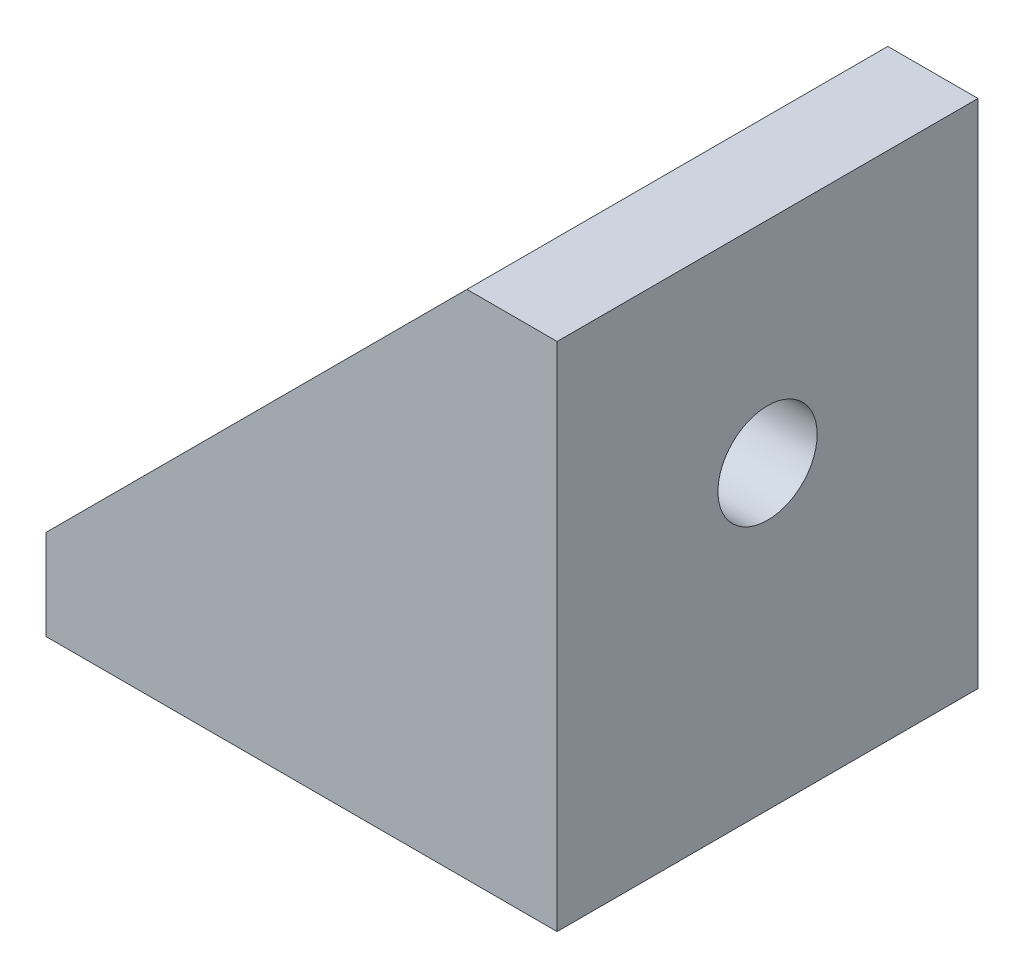
ISO-10303-21;
HEADER;
FILE_DESCRIPTION(('STEP AP214'),'2;1');
FILE_NAME('part.step','',(''),(''),'','','');
FILE_SCHEMA(('AUTOMOTIVE_DESIGN { 1 0 10303 214 1 1 1 1 }'));
ENDSEC;
DATA;
#1=APPLICATION_CONTEXT('core data for automotive mechanical design processes');
#2=APPLICATION_PROTOCOL_DEFINITION('international standard','automotive_design',2000,#1);
#3=PRODUCT_CONTEXT('',#1,'mechanical');
#4=PRODUCT('Part','Part','',(#3));
#5=PRODUCT_RELATED_PRODUCT_CATEGORY('part','',(#4));
#6=PRODUCT_DEFINITION_FORMATION('','',#4);
#7=PRODUCT_DEFINITION_CONTEXT('part definition',#1,'design');
#8=PRODUCT_DEFINITION('design','',#6,#7);
#9=PRODUCT_DEFINITION_SHAPE('','',#8);
#10=(LENGTH_UNIT() NAMED_UNIT(*) SI_UNIT(.MILLI.,.METRE.));
#11=(NAMED_UNIT(*) PLANE_ANGLE_UNIT() SI_UNIT($,.RADIAN.));
#12=(NAMED_UNIT(*) SI_UNIT($,.STERADIAN.) SOLID_ANGLE_UNIT());
#13=UNCERTAINTY_MEASURE_WITH_UNIT(LENGTH_MEASURE(1.E-05),#10,'distance_accuracy_value','');
#14=(GEOMETRIC_REPRESENTATION_CONTEXT(3) GLOBAL_UNCERTAINTY_ASSIGNED_CONTEXT((#13)) GLOBAL_UNIT_ASSIGNED_CONTEXT((#10,
#11,#12)) REPRESENTATION_CONTEXT('',''));
#15=CARTESIAN_POINT('',(0.,0.,0.));
#16=DIRECTION('',(0.,0.,1.));
#17=DIRECTION('',(1.,0.,0.));
#18=AXIS2_PLACEMENT_3D('',#15,#16,#17);
#19=CARTESIAN_POINT('',(0.,3.,0.));
#20=DIRECTION('',(0.,-1.,0.));
#21=DIRECTION('',(0.,0.,-1.));
#22=AXIS2_PLACEMENT_3D('',#19,#20,#21);
#23=PLANE('',#22);
#24=CARTESIAN_POINT('',(-7.,3.,-7.));
#25=DIRECTION('',(0.,1.,0.));
#26=DIRECTION('',(0.,0.,1.));
#27=AXIS2_PLACEMENT_3D('',#24,#25,#26);
#28=CIRCLE('',#27,1.75);
#29=CARTESIAN_POINT('',(-7.,3.,-5.25));
#30=VERTEX_POINT('',#29);
#31=EDGE_CURVE('E130',#30,#30,#28,.T.);
#32=ORIENTED_EDGE('',*,*,#31,.F.);
#33=EDGE_LOOP('',(#32));
#34=FACE_BOUND('',#33,.T.);
#35=DIRECTION('',(-1.,0.,0.));
#36=VECTOR('',#35,1.);
#37=CARTESIAN_POINT('',(0.,3.,-12.));
#38=LINE('',#37,#36);
#39=CARTESIAN_POINT('',(0.,3.,-12.));
#40=VERTEX_POINT('',#39);
#41=CARTESIAN_POINT('',(-14.,3.,-12.));
#42=VERTEX_POINT('',#41);
#43=EDGE_CURVE('E97',#40,#42,#38,.T.);
#44=ORIENTED_EDGE('',*,*,#43,.T.);
#45=DIRECTION('',(0.,0.,1.));
#46=VECTOR('',#45,1.);
#47=CARTESIAN_POINT('',(-14.,3.,0.));
#48=LINE('',#47,#46);
#49=CARTESIAN_POINT('',(-14.,3.,-2.));
#50=VERTEX_POINT('',#49);
#51=EDGE_CURVE('E118',#42,#50,#48,.T.);
#52=ORIENTED_EDGE('',*,*,#51,.T.);
#53=DIRECTION('',(1.,0.,0.));
#54=VECTOR('',#53,1.);
#55=CARTESIAN_POINT('',(-14.,3.,-2.));
#56=LINE('',#55,#54);
#57=CARTESIAN_POINT('',(0.,3.,-2.));
#58=VERTEX_POINT('',#57);
#59=EDGE_CURVE('E117',#50,#58,#56,.T.);
#60=ORIENTED_EDGE('',*,*,#59,.T.);
#61=DIRECTION('',(0.,0.,-1.));
#62=VECTOR('',#61,1.);
#63=CARTESIAN_POINT('',(0.,3.,-14.));
#64=LINE('',#63,#62);
#65=EDGE_CURVE('E110',#58,#40,#64,.T.);
#66=ORIENTED_EDGE('',*,*,#65,.T.);
#67=EDGE_LOOP('',(#44,#52,#60,#66));
#68=FACE_BOUND('',#67,.T.);
#69=ADVANCED_FACE('F32',(#34,#68),#23,.F.);
#70=CARTESIAN_POINT('',(0.,0.,0.));
#71=DIRECTION('',(-1.,0.,0.));
#72=DIRECTION('',(0.,0.,1.));
#73=AXIS2_PLACEMENT_3D('',#70,#71,#72);
#74=PLANE('',#73);
#75=CARTESIAN_POINT('',(0.,10.,-7.));
#76=DIRECTION('',(1.,0.,0.));
#77=DIRECTION('',(0.,0.,-1.));
#78=AXIS2_PLACEMENT_3D('',#75,#76,#77);
#79=CIRCLE('',#78,1.65);
#80=CARTESIAN_POINT('',(0.,10.,-8.65));
#81=VERTEX_POINT('',#80);
#82=EDGE_CURVE('E160',#81,#81,#79,.T.);
#83=ORIENTED_EDGE('',*,*,#82,.T.);
#84=EDGE_LOOP('',(#83));
#85=FACE_BOUND('',#84,.T.);
#86=DIRECTION('',(0.,0.,1.));
#87=VECTOR('',#86,1.);
#88=CARTESIAN_POINT('',(0.,17.,0.));
#89=LINE('',#88,#87);
#90=CARTESIAN_POINT('',(0.,17.,-12.));
#91=VERTEX_POINT('',#90);
#92=CARTESIAN_POINT('',(0.,17.,-2.));
#93=VERTEX_POINT('',#92);
#94=EDGE_CURVE('E111',#91,#93,#89,.T.);
#95=ORIENTED_EDGE('',*,*,#94,.F.);
#96=DIRECTION('',(0.,-1.,0.));
#97=VECTOR('',#96,1.);
#98=CARTESIAN_POINT('',(0.,17.,-12.));
#99=LINE('',#98,#97);
#100=EDGE_CURVE('E100',#91,#40,#99,.T.);
#101=ORIENTED_EDGE('',*,*,#100,.T.);
#102=ORIENTED_EDGE('',*,*,#65,.F.);
#103=DIRECTION('',(0.,1.,0.));
#104=VECTOR('',#103,1.);
#105=CARTESIAN_POINT('',(0.,3.,-2.));
#106=LINE('',#105,#104);
#107=EDGE_CURVE('E220',#58,#93,#106,.T.);
#108=ORIENTED_EDGE('',*,*,#107,.T.);
#109=EDGE_LOOP('',(#95,#101,#102,#108));
#110=FACE_BOUND('',#109,.T.);
#111=ADVANCED_FACE('F108',(#85,#110),#74,.T.);
#112=CARTESIAN_POINT('',(0.,0.,0.));
#113=DIRECTION('',(0.,-1.,0.));
#114=DIRECTION('',(0.,0.,-1.));
#115=AXIS2_PLACEMENT_3D('',#112,#113,#114);
#116=PLANE('',#115);
#117=DIRECTION('',(-1.,0.,0.));
#118=VECTOR('',#117,1.);
#119=CARTESIAN_POINT('',(-14.,0.,-14.));
#120=LINE('',#119,#118);
#121=CARTESIAN_POINT('',(3.,0.,-14.));
#122=VERTEX_POINT('',#121);
#123=CARTESIAN_POINT('',(-14.,0.,-14.));
#124=VERTEX_POINT('',#123);
#125=EDGE_CURVE('E128',#122,#124,#120,.T.);
#126=ORIENTED_EDGE('',*,*,#125,.F.);
#127=DIRECTION('',(0.,0.,-1.));
#128=VECTOR('',#127,1.);
#129=CARTESIAN_POINT('',(3.,0.,0.));
#130=LINE('',#129,#128);
#131=CARTESIAN_POINT('',(3.,0.,0.));
#132=VERTEX_POINT('',#131);
#133=EDGE_CURVE('E144',#132,#122,#130,.T.);
#134=ORIENTED_EDGE('',*,*,#133,.F.);
#135=DIRECTION('',(1.,0.,0.));
#136=VECTOR('',#135,1.);
#137=CARTESIAN_POINT('',(0.,0.,0.));
#138=LINE('',#137,#136);
#139=CARTESIAN_POINT('',(-14.,0.,0.));
#140=VERTEX_POINT('',#139);
#141=EDGE_CURVE('E119',#140,#132,#138,.T.);
#142=ORIENTED_EDGE('',*,*,#141,.F.);
#143=DIRECTION('',(0.,0.,1.));
#144=VECTOR('',#143,1.);
#145=CARTESIAN_POINT('',(-14.,0.,0.));
#146=LINE('',#145,#144);
#147=EDGE_CURVE('E54',#124,#140,#146,.T.);
#148=ORIENTED_EDGE('',*,*,#147,.F.);
#149=EDGE_LOOP('',(#126,#134,#142,#148));
#150=FACE_BOUND('',#149,.T.);
#151=CARTESIAN_POINT('',(-7.,0.,-7.));
#152=DIRECTION('',(0.,1.,0.));
#153=DIRECTION('',(0.,0.,1.));
#154=AXIS2_PLACEMENT_3D('',#151,#152,#153);
#155=CIRCLE('',#154,1.75);
#156=CARTESIAN_POINT('',(-7.,0.,-5.25));
#157=VERTEX_POINT('',#156);
#158=EDGE_CURVE('E125',#157,#157,#155,.T.);
#159=ORIENTED_EDGE('',*,*,#158,.T.);
#160=EDGE_LOOP('',(#159));
#161=FACE_BOUND('',#160,.T.);
#162=ADVANCED_FACE('F141',(#150,#161),#116,.T.);
#163=CARTESIAN_POINT('',(-14.,3.,-14.));
#164=DIRECTION('',(0.,0.,1.));
#165=DIRECTION('',(1.,0.,0.));
#166=AXIS2_PLACEMENT_3D('',#163,#164,#165);
#167=PLANE('',#166);
#168=DIRECTION('',(0.707106781186547,0.707106781186547,0.));
#169=VECTOR('',#168,1.);
#170=CARTESIAN_POINT('',(-14.,3.,-14.));
#171=LINE('',#170,#169);
#172=CARTESIAN_POINT('',(-14.,3.,-14.));
#173=VERTEX_POINT('',#172);
#174=CARTESIAN_POINT('',(0.,17.,-14.));
#175=VERTEX_POINT('',#174);
#176=EDGE_CURVE('E113',#173,#175,#171,.T.);
#177=ORIENTED_EDGE('',*,*,#176,.T.);
#178=DIRECTION('',(-1.,0.,0.));
#179=VECTOR('',#178,1.);
#180=CARTESIAN_POINT('',(3.,17.,-14.));
#181=LINE('',#180,#179);
#182=CARTESIAN_POINT('',(3.,17.,-14.));
#183=VERTEX_POINT('',#182);
#184=EDGE_CURVE('E167',#183,#175,#181,.T.);
#185=ORIENTED_EDGE('',*,*,#184,.F.);
#186=DIRECTION('',(0.,1.,0.));
#187=VECTOR('',#186,1.);
#188=CARTESIAN_POINT('',(3.,0.,-14.));
#189=LINE('',#188,#187);
#190=EDGE_CURVE('E148',#122,#183,#189,.T.);
#191=ORIENTED_EDGE('',*,*,#190,.F.);
#192=ORIENTED_EDGE('',*,*,#125,.T.);
#193=DIRECTION('',(0.,-1.,0.));
#194=VECTOR('',#193,1.);
#195=CARTESIAN_POINT('',(-14.,3.,-14.));
#196=LINE('',#195,#194);
#197=EDGE_CURVE('E11',#173,#124,#196,.T.);
#198=ORIENTED_EDGE('',*,*,#197,.F.);
#199=EDGE_LOOP('',(#177,#185,#191,#192,#198));
#200=FACE_BOUND('',#199,.T.);
#201=ADVANCED_FACE('F34',(#200),#167,.F.);
#202=CARTESIAN_POINT('',(-14.,3.,0.));
#203=DIRECTION('',(1.,0.,0.));
#204=DIRECTION('',(0.,0.,-1.));
#205=AXIS2_PLACEMENT_3D('',#202,#203,#204);
#206=PLANE('',#205);
#207=ORIENTED_EDGE('',*,*,#147,.T.);
#208=DIRECTION('',(0.,-1.,0.));
#209=VECTOR('',#208,1.);
#210=CARTESIAN_POINT('',(-14.,3.,0.));
#211=LINE('',#210,#209);
#212=CARTESIAN_POINT('',(-14.,3.,0.));
#213=VERTEX_POINT('',#212);
#214=EDGE_CURVE('E40',#213,#140,#211,.T.);
#215=ORIENTED_EDGE('',*,*,#214,.F.);
#216=DIRECTION('',(0.,0.,1.));
#217=VECTOR('',#216,1.);
#218=CARTESIAN_POINT('',(-14.,3.,-2.));
#219=LINE('',#218,#217);
#220=EDGE_CURVE('E216',#50,#213,#219,.T.);
#221=ORIENTED_EDGE('',*,*,#220,.F.);
#222=ORIENTED_EDGE('',*,*,#51,.F.);
#223=EDGE_CURVE('E121',#173,#42,#48,.T.);
#224=ORIENTED_EDGE('',*,*,#223,.F.);
#225=ORIENTED_EDGE('',*,*,#197,.T.);
#226=EDGE_LOOP('',(#207,#215,#221,#222,#224,#225));
#227=FACE_BOUND('',#226,.T.);
#228=ADVANCED_FACE('F184',(#227),#206,.F.);
#229=CARTESIAN_POINT('',(0.,3.,0.));
#230=DIRECTION('',(0.,0.,-1.));
#231=DIRECTION('',(-1.,0.,0.));
#232=AXIS2_PLACEMENT_3D('',#229,#230,#231);
#233=PLANE('',#232);
#234=ORIENTED_EDGE('',*,*,#141,.T.);
#235=DIRECTION('',(0.,-1.,0.));
#236=VECTOR('',#235,1.);
#237=CARTESIAN_POINT('',(3.,0.,0.));
#238=LINE('',#237,#236);
#239=CARTESIAN_POINT('',(3.,17.,0.));
#240=VERTEX_POINT('',#239);
#241=EDGE_CURVE('E149',#240,#132,#238,.T.);
#242=ORIENTED_EDGE('',*,*,#241,.F.);
#243=DIRECTION('',(-1.,0.,0.));
#244=VECTOR('',#243,1.);
#245=CARTESIAN_POINT('',(3.,17.,0.));
#246=LINE('',#245,#244);
#247=CARTESIAN_POINT('',(0.,17.,0.));
#248=VERTEX_POINT('',#247);
#249=EDGE_CURVE('E164',#240,#248,#246,.T.);
#250=ORIENTED_EDGE('',*,*,#249,.T.);
#251=DIRECTION('',(-0.707106781186547,-0.707106781186547,0.));
#252=VECTOR('',#251,1.);
#253=CARTESIAN_POINT('',(0.,17.,0.));
#254=LINE('',#253,#252);
#255=EDGE_CURVE('E138',#248,#213,#254,.T.);
#256=ORIENTED_EDGE('',*,*,#255,.T.);
#257=ORIENTED_EDGE('',*,*,#214,.T.);
#258=EDGE_LOOP('',(#234,#242,#250,#256,#257));
#259=FACE_BOUND('',#258,.T.);
#260=ADVANCED_FACE('F134',(#259),#233,.F.);
#261=CARTESIAN_POINT('',(-7.,3.,-7.));
#262=DIRECTION('',(0.,-1.,0.));
#263=DIRECTION('',(0.,0.,-1.));
#264=AXIS2_PLACEMENT_3D('',#261,#262,#263);
#265=CYLINDRICAL_SURFACE('',#264,1.75);
#266=ORIENTED_EDGE('',*,*,#31,.T.);
#267=EDGE_LOOP('',(#266));
#268=FACE_BOUND('',#267,.T.);
#269=ORIENTED_EDGE('',*,*,#158,.F.);
#270=EDGE_LOOP('',(#269));
#271=FACE_BOUND('',#270,.T.);
#272=ADVANCED_FACE('F175',(#268,#271),#265,.F.);
#273=CARTESIAN_POINT('',(3.,0.,0.));
#274=DIRECTION('',(-1.,0.,0.));
#275=DIRECTION('',(0.,0.,1.));
#276=AXIS2_PLACEMENT_3D('',#273,#274,#275);
#277=PLANE('',#276);
#278=ORIENTED_EDGE('',*,*,#241,.T.);
#279=ORIENTED_EDGE('',*,*,#133,.T.);
#280=ORIENTED_EDGE('',*,*,#190,.T.);
#281=DIRECTION('',(0.,0.,1.));
#282=VECTOR('',#281,1.);
#283=CARTESIAN_POINT('',(3.,17.,0.));
#284=LINE('',#283,#282);
#285=EDGE_CURVE('E154',#183,#240,#284,.T.);
#286=ORIENTED_EDGE('',*,*,#285,.T.);
#287=EDGE_LOOP('',(#278,#279,#280,#286));
#288=FACE_BOUND('',#287,.T.);
#289=CARTESIAN_POINT('',(3.,10.,-7.));
#290=DIRECTION('',(1.,0.,0.));
#291=DIRECTION('',(0.,0.,-1.));
#292=AXIS2_PLACEMENT_3D('',#289,#290,#291);
#293=CIRCLE('',#292,1.65);
#294=CARTESIAN_POINT('',(3.,10.,-8.65));
#295=VERTEX_POINT('',#294);
#296=EDGE_CURVE('E223',#295,#295,#293,.T.);
#297=ORIENTED_EDGE('',*,*,#296,.F.);
#298=EDGE_LOOP('',(#297));
#299=FACE_BOUND('',#298,.T.);
#300=ADVANCED_FACE('F151',(#288,#299),#277,.F.);
#301=CARTESIAN_POINT('',(3.,17.,0.));
#302=DIRECTION('',(0.,-1.,0.));
#303=DIRECTION('',(0.,0.,-1.));
#304=AXIS2_PLACEMENT_3D('',#301,#302,#303);
#305=PLANE('',#304);
#306=EDGE_CURVE('E156',#175,#91,#89,.T.);
#307=ORIENTED_EDGE('',*,*,#306,.T.);
#308=ORIENTED_EDGE('',*,*,#94,.T.);
#309=DIRECTION('',(0.,0.,1.));
#310=VECTOR('',#309,1.);
#311=CARTESIAN_POINT('',(0.,17.,-2.));
#312=LINE('',#311,#310);
#313=EDGE_CURVE('E212',#93,#248,#312,.T.);
#314=ORIENTED_EDGE('',*,*,#313,.T.);
#315=ORIENTED_EDGE('',*,*,#249,.F.);
#316=ORIENTED_EDGE('',*,*,#285,.F.);
#317=ORIENTED_EDGE('',*,*,#184,.T.);
#318=EDGE_LOOP('',(#307,#308,#314,#315,#316,#317));
#319=FACE_BOUND('',#318,.T.);
#320=ADVANCED_FACE('F182',(#319),#305,.F.);
#321=CARTESIAN_POINT('',(3.,10.,-7.));
#322=DIRECTION('',(-1.,0.,0.));
#323=DIRECTION('',(0.,0.,1.));
#324=AXIS2_PLACEMENT_3D('',#321,#322,#323);
#325=CYLINDRICAL_SURFACE('',#324,1.65);
#326=ORIENTED_EDGE('',*,*,#296,.T.);
#327=EDGE_LOOP('',(#326));
#328=FACE_BOUND('',#327,.T.);
#329=ORIENTED_EDGE('',*,*,#82,.F.);
#330=EDGE_LOOP('',(#329));
#331=FACE_BOUND('',#330,.T.);
#332=ADVANCED_FACE('F230',(#328,#331),#325,.F.);
#333=CARTESIAN_POINT('',(0.,17.,-2.));
#334=DIRECTION('',(-0.707106781186547,0.707106781186547,0.));
#335=DIRECTION('',(-0.707106781186548,-0.707106781186548,0.));
#336=AXIS2_PLACEMENT_3D('',#333,#334,#335);
#337=PLANE('',#336);
#338=ORIENTED_EDGE('',*,*,#255,.F.);
#339=ORIENTED_EDGE('',*,*,#313,.F.);
#340=DIRECTION('',(-0.707106781186547,-0.707106781186547,0.));
#341=VECTOR('',#340,1.);
#342=CARTESIAN_POINT('',(0.,17.,-2.));
#343=LINE('',#342,#341);
#344=EDGE_CURVE('E217',#93,#50,#343,.T.);
#345=ORIENTED_EDGE('',*,*,#344,.T.);
#346=ORIENTED_EDGE('',*,*,#220,.T.);
#347=EDGE_LOOP('',(#338,#339,#345,#346));
#348=FACE_BOUND('',#347,.T.);
#349=ADVANCED_FACE('F232',(#348),#337,.T.);
#350=CARTESIAN_POINT('',(0.,0.,-2.));
#351=DIRECTION('',(0.,0.,1.));
#352=DIRECTION('',(1.,0.,0.));
#353=AXIS2_PLACEMENT_3D('',#350,#351,#352);
#354=PLANE('',#353);
#355=ORIENTED_EDGE('',*,*,#59,.F.);
#356=ORIENTED_EDGE('',*,*,#344,.F.);
#357=ORIENTED_EDGE('',*,*,#107,.F.);
#358=EDGE_LOOP('',(#355,#356,#357));
#359=FACE_BOUND('',#358,.T.);
#360=ADVANCED_FACE('F238',(#359),#354,.F.);
#361=CARTESIAN_POINT('',(-14.,3.,-12.));
#362=DIRECTION('',(-0.707106781186548,0.707106781186548,0.));
#363=DIRECTION('',(-0.707106781186547,-0.707106781186548,0.));
#364=AXIS2_PLACEMENT_3D('',#361,#362,#363);
#365=PLANE('',#364);
#366=ORIENTED_EDGE('',*,*,#176,.F.);
#367=ORIENTED_EDGE('',*,*,#223,.T.);
#368=DIRECTION('',(0.707106781186547,0.707106781186547,0.));
#369=VECTOR('',#368,1.);
#370=CARTESIAN_POINT('',(-14.,3.,-12.));
#371=LINE('',#370,#369);
#372=EDGE_CURVE('E47',#42,#91,#371,.T.);
#373=ORIENTED_EDGE('',*,*,#372,.T.);
#374=ORIENTED_EDGE('',*,*,#306,.F.);
#375=EDGE_LOOP('',(#366,#367,#373,#374));
#376=FACE_BOUND('',#375,.T.);
#377=ADVANCED_FACE('F243',(#376),#365,.T.);
#378=CARTESIAN_POINT('',(0.,0.,-12.));
#379=DIRECTION('',(0.,0.,-1.));
#380=DIRECTION('',(-1.,0.,0.));
#381=AXIS2_PLACEMENT_3D('',#378,#379,#380);
#382=PLANE('',#381);
#383=ORIENTED_EDGE('',*,*,#100,.F.);
#384=ORIENTED_EDGE('',*,*,#372,.F.);
#385=ORIENTED_EDGE('',*,*,#43,.F.);
#386=EDGE_LOOP('',(#383,#384,#385));
#387=FACE_BOUND('',#386,.T.);
#388=ADVANCED_FACE('F99',(#387),#382,.F.);
#389=CLOSED_SHELL('',(#69,#111,#162,#201,#228,#260,#272,#300,#320,#332,#349,#360,#377,#388));
#390=MANIFOLD_SOLID_BREP('B2',#389);
#391=ADVANCED_BREP_SHAPE_REPRESENTATION('',(#18,#390),#14);
#392=SHAPE_DEFINITION_REPRESENTATION(#9,#391);
ENDSEC;
END-ISO-10303-21;
